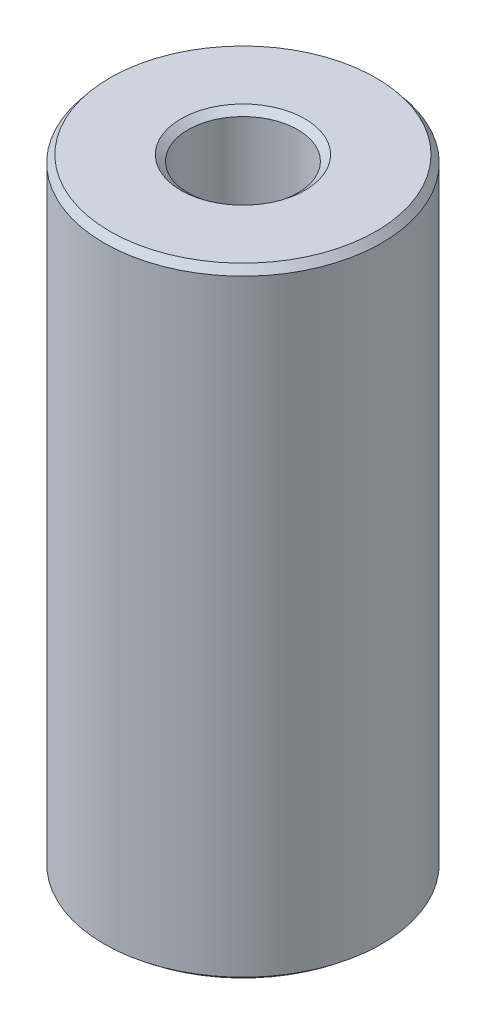
ISO-10303-21;
HEADER;
FILE_DESCRIPTION(('STEP AP214'),'2;1');
FILE_NAME('part.step','',(''),(''),'','','');
FILE_SCHEMA(('AUTOMOTIVE_DESIGN { 1 0 10303 214 1 1 1 1 }'));
ENDSEC;
DATA;
#1=APPLICATION_CONTEXT('core data for automotive mechanical design processes');
#2=APPLICATION_PROTOCOL_DEFINITION('international standard','automotive_design',2000,#1);
#3=PRODUCT_CONTEXT('',#1,'mechanical');
#4=PRODUCT('Part','Part','',(#3));
#5=PRODUCT_RELATED_PRODUCT_CATEGORY('part','',(#4));
#6=PRODUCT_DEFINITION_FORMATION('','',#4);
#7=PRODUCT_DEFINITION_CONTEXT('part definition',#1,'design');
#8=PRODUCT_DEFINITION('design','',#6,#7);
#9=PRODUCT_DEFINITION_SHAPE('','',#8);
#10=(LENGTH_UNIT() NAMED_UNIT(*) SI_UNIT(.MILLI.,.METRE.));
#11=(NAMED_UNIT(*) PLANE_ANGLE_UNIT() SI_UNIT($,.RADIAN.));
#12=(NAMED_UNIT(*) SI_UNIT($,.STERADIAN.) SOLID_ANGLE_UNIT());
#13=UNCERTAINTY_MEASURE_WITH_UNIT(LENGTH_MEASURE(1.E-05),#10,'distance_accuracy_value','');
#14=(GEOMETRIC_REPRESENTATION_CONTEXT(3) GLOBAL_UNCERTAINTY_ASSIGNED_CONTEXT((#13)) GLOBAL_UNIT_ASSIGNED_CONTEXT((#10,
#11,#12)) REPRESENTATION_CONTEXT('',''));
#15=CARTESIAN_POINT('',(0.,0.,0.));
#16=DIRECTION('',(0.,0.,1.));
#17=DIRECTION('',(1.,0.,0.));
#18=AXIS2_PLACEMENT_3D('',#15,#16,#17);
#19=CARTESIAN_POINT('',(0.,256.877143533547,0.));
#20=DIRECTION('',(0.,-1.,0.));
#21=DIRECTION('',(0.,0.,-1.));
#22=AXIS2_PLACEMENT_3D('',#19,#20,#21);
#23=CYLINDRICAL_SURFACE('',#22,57.5);
#24=CARTESIAN_POINT('',(0.,2.40064498722986,0.));
#25=DIRECTION('',(0.,1.,0.));
#26=DIRECTION('',(0.,0.,1.));
#27=AXIS2_PLACEMENT_3D('',#24,#25,#26);
#28=CIRCLE('',#27,57.5);
#29=CARTESIAN_POINT('',(0.,2.40064498722986,57.5));
#30=VERTEX_POINT('',#29);
#31=EDGE_CURVE('E10',#30,#30,#28,.T.);
#32=ORIENTED_EDGE('',*,*,#31,.T.);
#33=EDGE_LOOP('',(#32));
#34=FACE_BOUND('',#33,.T.);
#35=CARTESIAN_POINT('',(0.,253.895983073339,0.));
#36=DIRECTION('',(0.,1.,0.));
#37=DIRECTION('',(0.,0.,1.));
#38=AXIS2_PLACEMENT_3D('',#35,#36,#37);
#39=CIRCLE('',#38,57.5);
#40=CARTESIAN_POINT('',(0.,253.895983073339,57.5));
#41=VERTEX_POINT('',#40);
#42=EDGE_CURVE('E50',#41,#41,#39,.F.);
#43=ORIENTED_EDGE('',*,*,#42,.T.);
#44=EDGE_LOOP('',(#43));
#45=FACE_BOUND('',#44,.T.);
#46=ADVANCED_FACE('F39',(#34,#45),#23,.T.);
#47=CARTESIAN_POINT('',(0.,256.877143533547,0.));
#48=DIRECTION('',(0.,1.,0.));
#49=DIRECTION('',(0.,0.,1.));
#50=AXIS2_PLACEMENT_3D('',#47,#48,#49);
#51=PLANE('',#50);
#52=CARTESIAN_POINT('',(0.,256.877143533547,0.));
#53=DIRECTION('',(0.,1.,0.));
#54=DIRECTION('',(0.,0.,1.));
#55=AXIS2_PLACEMENT_3D('',#52,#53,#54);
#56=CIRCLE('',#55,25.6889836546999);
#57=CARTESIAN_POINT('',(0.,256.877143533547,25.6889836546999));
#58=VERTEX_POINT('',#57);
#59=EDGE_CURVE('E58',#58,#58,#56,.F.);
#60=ORIENTED_EDGE('',*,*,#59,.T.);
#61=EDGE_LOOP('',(#60));
#62=FACE_BOUND('',#61,.T.);
#63=CARTESIAN_POINT('',(0.,256.877143533547,0.));
#64=DIRECTION('',(0.,1.,0.));
#65=DIRECTION('',(0.,0.,1.));
#66=AXIS2_PLACEMENT_3D('',#63,#64,#65);
#67=CIRCLE('',#66,55.0993550127702);
#68=CARTESIAN_POINT('',(0.,256.877143533547,55.0993550127702));
#69=VERTEX_POINT('',#68);
#70=EDGE_CURVE('E61',#69,#69,#67,.T.);
#71=ORIENTED_EDGE('',*,*,#70,.T.);
#72=EDGE_LOOP('',(#71));
#73=FACE_BOUND('',#72,.T.);
#74=ADVANCED_FACE('F88',(#62,#73),#51,.T.);
#75=CARTESIAN_POINT('',(0.,0.,0.));
#76=DIRECTION('',(0.,1.,0.));
#77=DIRECTION('',(0.,0.,1.));
#78=AXIS2_PLACEMENT_3D('',#75,#76,#77);
#79=PLANE('',#78);
#80=CARTESIAN_POINT('',(0.,0.,0.));
#81=DIRECTION('',(0.,1.,0.));
#82=DIRECTION('',(0.,0.,1.));
#83=AXIS2_PLACEMENT_3D('',#80,#81,#82);
#84=CIRCLE('',#83,25.1084681817216);
#85=CARTESIAN_POINT('',(0.,0.,25.1084681817216));
#86=VERTEX_POINT('',#85);
#87=EDGE_CURVE('E51',#86,#86,#84,.T.);
#88=ORIENTED_EDGE('',*,*,#87,.T.);
#89=EDGE_LOOP('',(#88));
#90=FACE_BOUND('',#89,.T.);
#91=CARTESIAN_POINT('',(0.,0.,0.));
#92=DIRECTION('',(0.,1.,0.));
#93=DIRECTION('',(0.,0.,1.));
#94=AXIS2_PLACEMENT_3D('',#91,#92,#93);
#95=CIRCLE('',#94,54.5188395397919);
#96=CARTESIAN_POINT('',(0.,0.,54.5188395397919));
#97=VERTEX_POINT('',#96);
#98=EDGE_CURVE('E54',#97,#97,#95,.F.);
#99=ORIENTED_EDGE('',*,*,#98,.T.);
#100=EDGE_LOOP('',(#99));
#101=FACE_BOUND('',#100,.T.);
#102=ADVANCED_FACE('F83',(#90,#101),#79,.F.);
#103=CARTESIAN_POINT('',(0.,256.877143533547,0.));
#104=DIRECTION('',(0.,-1.,0.));
#105=DIRECTION('',(0.,0.,-1.));
#106=AXIS2_PLACEMENT_3D('',#103,#104,#105);
#107=CYLINDRICAL_SURFACE('',#106,22.7078231944917);
#108=CARTESIAN_POINT('',(0.,254.476498546318,0.));
#109=DIRECTION('',(0.,1.,0.));
#110=DIRECTION('',(0.,0.,1.));
#111=AXIS2_PLACEMENT_3D('',#108,#109,#110);
#112=CIRCLE('',#111,22.7078231944917);
#113=CARTESIAN_POINT('',(0.,254.476498546318,22.7078231944917));
#114=VERTEX_POINT('',#113);
#115=EDGE_CURVE('E67',#114,#114,#112,.T.);
#116=ORIENTED_EDGE('',*,*,#115,.T.);
#117=EDGE_LOOP('',(#116));
#118=FACE_BOUND('',#117,.T.);
#119=CARTESIAN_POINT('',(0.,2.98116046020813,0.));
#120=DIRECTION('',(0.,1.,0.));
#121=DIRECTION('',(0.,0.,1.));
#122=AXIS2_PLACEMENT_3D('',#119,#120,#121);
#123=CIRCLE('',#122,22.7078231944917);
#124=CARTESIAN_POINT('',(0.,2.98116046020813,22.7078231944917));
#125=VERTEX_POINT('',#124);
#126=EDGE_CURVE('E69',#125,#125,#123,.F.);
#127=ORIENTED_EDGE('',*,*,#126,.T.);
#128=EDGE_LOOP('',(#127));
#129=FACE_BOUND('',#128,.T.);
#130=ADVANCED_FACE('F71',(#118,#129),#107,.F.);
#131=CARTESIAN_POINT('',(0.,254.476498546318,0.));
#132=DIRECTION('',(0.,1.,0.));
#133=DIRECTION('',(0.,0.,1.));
#134=AXIS2_PLACEMENT_3D('',#131,#132,#133);
#135=CONICAL_SURFACE('',#134,22.7078231944917,0.892849019287131);
#136=ORIENTED_EDGE('',*,*,#59,.F.);
#137=EDGE_LOOP('',(#136));
#138=FACE_BOUND('',#137,.T.);
#139=ORIENTED_EDGE('',*,*,#115,.F.);
#140=EDGE_LOOP('',(#139));
#141=FACE_BOUND('',#140,.T.);
#142=ADVANCED_FACE('F77',(#138,#141),#135,.F.);
#143=CARTESIAN_POINT('',(0.,0.,0.));
#144=DIRECTION('',(0.,-1.,0.));
#145=DIRECTION('',(0.,0.,-1.));
#146=AXIS2_PLACEMENT_3D('',#143,#144,#145);
#147=CONICAL_SURFACE('',#146,25.1084681817216,0.677947307507754);
#148=ORIENTED_EDGE('',*,*,#126,.F.);
#149=EDGE_LOOP('',(#148));
#150=FACE_BOUND('',#149,.T.);
#151=ORIENTED_EDGE('',*,*,#87,.F.);
#152=EDGE_LOOP('',(#151));
#153=FACE_BOUND('',#152,.T.);
#154=ADVANCED_FACE('F73',(#150,#153),#147,.F.);
#155=CARTESIAN_POINT('',(0.,2.40064498722986,0.));
#156=DIRECTION('',(0.,1.,0.));
#157=DIRECTION('',(0.,0.,1.));
#158=AXIS2_PLACEMENT_3D('',#155,#156,#157);
#159=CONICAL_SURFACE('',#158,57.5,0.892849019287138);
#160=ORIENTED_EDGE('',*,*,#98,.F.);
#161=EDGE_LOOP('',(#160));
#162=FACE_BOUND('',#161,.T.);
#163=ORIENTED_EDGE('',*,*,#31,.F.);
#164=EDGE_LOOP('',(#163));
#165=FACE_BOUND('',#164,.T.);
#166=ADVANCED_FACE('F76',(#162,#165),#159,.T.);
#167=CARTESIAN_POINT('',(0.,256.877143533547,0.));
#168=DIRECTION('',(0.,-1.,0.));
#169=DIRECTION('',(0.,0.,-1.));
#170=AXIS2_PLACEMENT_3D('',#167,#168,#169);
#171=CONICAL_SURFACE('',#170,55.0993550127702,0.677947307507756);
#172=ORIENTED_EDGE('',*,*,#42,.F.);
#173=EDGE_LOOP('',(#172));
#174=FACE_BOUND('',#173,.T.);
#175=ORIENTED_EDGE('',*,*,#70,.F.);
#176=EDGE_LOOP('',(#175));
#177=FACE_BOUND('',#176,.T.);
#178=ADVANCED_FACE('F45',(#174,#177),#171,.T.);
#179=CLOSED_SHELL('',(#46,#74,#102,#130,#142,#154,#166,#178));
#180=MANIFOLD_SOLID_BREP('B2',#179);
#181=ADVANCED_BREP_SHAPE_REPRESENTATION('',(#18,#180),#14);
#182=SHAPE_DEFINITION_REPRESENTATION(#9,#181);
ENDSEC;
END-ISO-10303-21;
